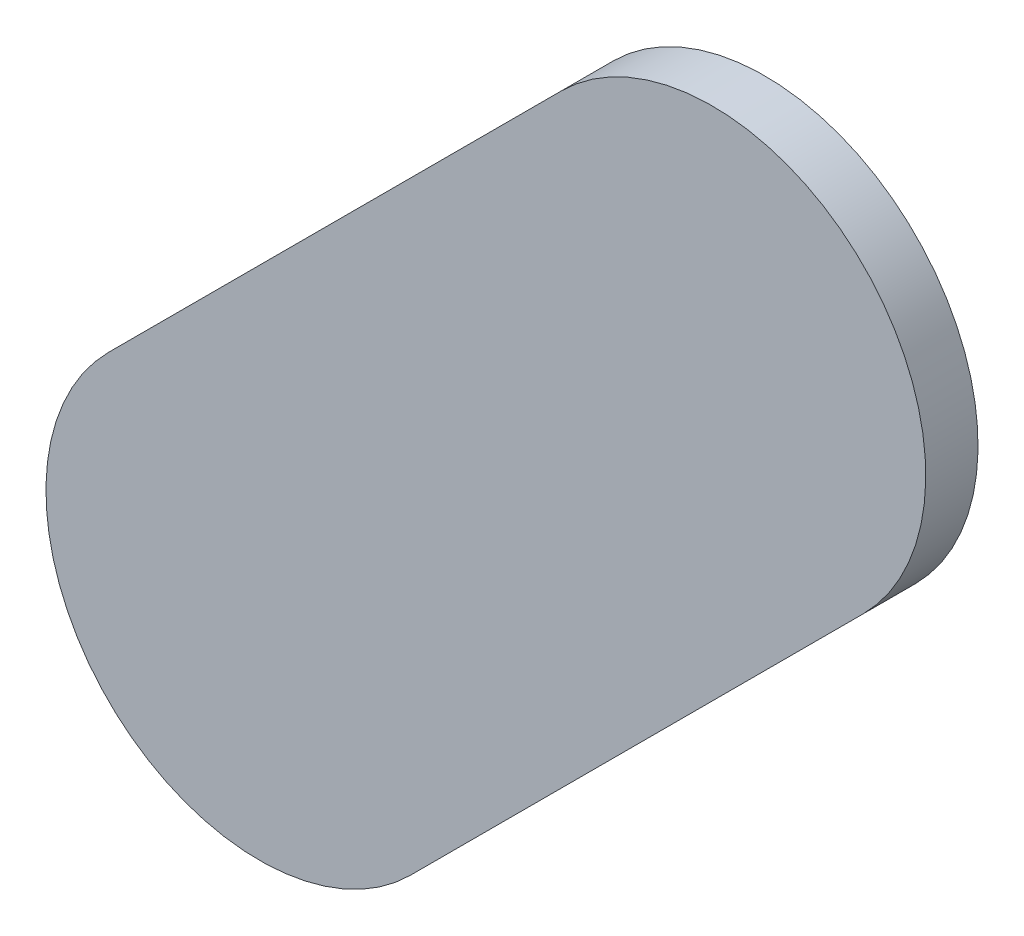
ISO-10303-21;
HEADER;
FILE_DESCRIPTION(('STEP AP214'),'2;1');
FILE_NAME('part.step','',(''),(''),'','','');
FILE_SCHEMA(('AUTOMOTIVE_DESIGN { 1 0 10303 214 1 1 1 1 }'));
ENDSEC;
DATA;
#1=APPLICATION_CONTEXT('core data for automotive mechanical design processes');
#2=APPLICATION_PROTOCOL_DEFINITION('international standard','automotive_design',2000,#1);
#3=PRODUCT_CONTEXT('',#1,'mechanical');
#4=PRODUCT('Part','Part','',(#3));
#5=PRODUCT_RELATED_PRODUCT_CATEGORY('part','',(#4));
#6=PRODUCT_DEFINITION_FORMATION('','',#4);
#7=PRODUCT_DEFINITION_CONTEXT('part definition',#1,'design');
#8=PRODUCT_DEFINITION('design','',#6,#7);
#9=PRODUCT_DEFINITION_SHAPE('','',#8);
#10=(LENGTH_UNIT() NAMED_UNIT(*) SI_UNIT(.MILLI.,.METRE.));
#11=(NAMED_UNIT(*) PLANE_ANGLE_UNIT() SI_UNIT($,.RADIAN.));
#12=(NAMED_UNIT(*) SI_UNIT($,.STERADIAN.) SOLID_ANGLE_UNIT());
#13=UNCERTAINTY_MEASURE_WITH_UNIT(LENGTH_MEASURE(1.E-05),#10,'distance_accuracy_value','');
#14=(GEOMETRIC_REPRESENTATION_CONTEXT(3) GLOBAL_UNCERTAINTY_ASSIGNED_CONTEXT((#13)) GLOBAL_UNIT_ASSIGNED_CONTEXT((#10,
#11,#12)) REPRESENTATION_CONTEXT('',''));
#15=CARTESIAN_POINT('',(0.,0.,0.));
#16=DIRECTION('',(0.,0.,1.));
#17=DIRECTION('',(1.,0.,0.));
#18=AXIS2_PLACEMENT_3D('',#15,#16,#17);
#19=CARTESIAN_POINT('',(7.544412089748,6.263751311465,0.79916));
#20=DIRECTION('',(0.,0.,1.));
#21=DIRECTION('',(1.,0.,0.));
#22=AXIS2_PLACEMENT_3D('',#19,#20,#21);
#23=PLANE('',#22);
#24=CARTESIAN_POINT('',(7.395919333,6.115258667,0.79916));
#25=DIRECTION('',(0.,0.,1.));
#26=DIRECTION('',(1.,0.,0.));
#27=AXIS2_PLACEMENT_3D('',#24,#25,#26);
#28=CIRCLE('',#27,0.139999666);
#29=CARTESIAN_POINT('',(7.49491465012217,6.01626398312202,0.79916));
#30=VERTEX_POINT('',#29);
#31=CARTESIAN_POINT('',(7.29692473875643,6.21425349914002,0.79916));
#32=VERTEX_POINT('',#31);
#33=EDGE_CURVE('E20',#30,#32,#28,.F.);
#34=ORIENTED_EDGE('',*,*,#33,.F.);
#35=DIRECTION('',(-0.707106660628037,-0.707106901745037,0.));
#36=VECTOR('',#35,1.);
#37=CARTESIAN_POINT('',(7.791899282866,6.313248717135,0.79916));
#38=LINE('',#37,#36);
#39=CARTESIAN_POINT('',(7.79189945805482,6.31324889232387,0.79916));
#40=VERTEX_POINT('',#39);
#41=EDGE_CURVE('E65',#30,#40,#38,.F.);
#42=ORIENTED_EDGE('',*,*,#41,.T.);
#43=CARTESIAN_POINT('',(7.692904333,6.412243768268,0.79916));
#44=DIRECTION('',(0.,0.,1.));
#45=DIRECTION('',(1.,0.,0.));
#46=AXIS2_PLACEMENT_3D('',#43,#44,#45);
#47=CIRCLE('',#46,0.14);
#48=CARTESIAN_POINT('',(7.59390931051548,6.51123864451574,0.79916));
#49=VERTEX_POINT('',#48);
#50=EDGE_CURVE('E57',#49,#40,#47,.F.);
#51=ORIENTED_EDGE('',*,*,#50,.F.);
#52=DIRECTION('',(0.707106098309218,0.707107464063218,0.));
#53=VECTOR('',#52,1.);
#54=CARTESIAN_POINT('',(7.296924953307,6.214253713691,0.79916));
#55=LINE('',#54,#53);
#56=EDGE_CURVE('E64',#49,#32,#55,.F.);
#57=ORIENTED_EDGE('',*,*,#56,.T.);
#58=EDGE_LOOP('',(#34,#42,#51,#57));
#59=FACE_BOUND('',#58,.T.);
#60=ADVANCED_FACE('F17',(#59),#23,.T.);
#61=CARTESIAN_POINT('',(7.791899282866,6.313248717135,0.76487));
#62=DIRECTION('',(-0.707106901745037,0.707106660628037,0.));
#63=DIRECTION('',(-0.707106660628037,-0.707106901745037,0.));
#64=AXIS2_PLACEMENT_3D('',#61,#62,#63);
#65=PLANE('',#64);
#66=DIRECTION('',(0.,0.,1.));
#67=VECTOR('',#66,1.);
#68=CARTESIAN_POINT('',(7.4949146670001,6.0162639999999,0.76487));
#69=LINE('',#68,#67);
#70=CARTESIAN_POINT('',(7.49491465012214,6.01626398312203,0.76487));
#71=VERTEX_POINT('',#70);
#72=EDGE_CURVE('E68',#71,#30,#69,.T.);
#73=ORIENTED_EDGE('',*,*,#72,.F.);
#74=DIRECTION('',(-0.70710666062813,-0.707106901744945,0.));
#75=VECTOR('',#74,1.);
#76=CARTESIAN_POINT('',(7.791899282866,6.313248717135,0.76487));
#77=LINE('',#76,#75);
#78=CARTESIAN_POINT('',(7.79189945805481,6.31324889232387,0.76487));
#79=VERTEX_POINT('',#78);
#80=EDGE_CURVE('E72',#79,#71,#77,.T.);
#81=ORIENTED_EDGE('',*,*,#80,.F.);
#82=DIRECTION('',(0.,0.,1.));
#83=VECTOR('',#82,1.);
#84=CARTESIAN_POINT('',(7.791899282866,6.313248717135,0.76487));
#85=LINE('',#84,#83);
#86=EDGE_CURVE('E60',#40,#79,#85,.F.);
#87=ORIENTED_EDGE('',*,*,#86,.F.);
#88=ORIENTED_EDGE('',*,*,#41,.F.);
#89=EDGE_LOOP('',(#73,#81,#87,#88));
#90=FACE_BOUND('',#89,.T.);
#91=ADVANCED_FACE('F70',(#90),#65,.F.);
#92=CARTESIAN_POINT('',(7.395919333,6.115258667,0.76487));
#93=DIRECTION('',(0.,0.,1.));
#94=DIRECTION('',(1.,0.,0.));
#95=AXIS2_PLACEMENT_3D('',#92,#93,#94);
#96=CYLINDRICAL_SURFACE('',#95,0.139999666);
#97=DIRECTION('',(0.,0.,1.));
#98=VECTOR('',#97,1.);
#99=CARTESIAN_POINT('',(7.296924953307,6.214253713691,0.76487));
#100=LINE('',#99,#98);
#101=CARTESIAN_POINT('',(7.29692473875646,6.21425349914005,0.76487));
#102=VERTEX_POINT('',#101);
#103=EDGE_CURVE('E77',#32,#102,#100,.F.);
#104=ORIENTED_EDGE('',*,*,#103,.T.);
#105=CARTESIAN_POINT('',(7.395919667,6.115258898732,0.76487));
#106=DIRECTION('',(0.,0.,1.));
#107=DIRECTION('',(1.,0.,0.));
#108=AXIS2_PLACEMENT_3D('',#105,#106,#107);
#109=CIRCLE('',#108,0.14);
#110=EDGE_CURVE('E26',#71,#102,#109,.F.);
#111=ORIENTED_EDGE('',*,*,#110,.F.);
#112=ORIENTED_EDGE('',*,*,#72,.T.);
#113=ORIENTED_EDGE('',*,*,#33,.T.);
#114=EDGE_LOOP('',(#104,#111,#112,#113));
#115=FACE_BOUND('',#114,.T.);
#116=ADVANCED_FACE('F88',(#115),#96,.T.);
#117=CARTESIAN_POINT('',(7.296924953307,6.214253713691,0.76487));
#118=DIRECTION('',(0.707107464063218,-0.707106098309218,0.));
#119=DIRECTION('',(0.707106098309218,0.707107464063218,0.));
#120=AXIS2_PLACEMENT_3D('',#117,#118,#119);
#121=PLANE('',#120);
#122=DIRECTION('',(0.,0.,1.));
#123=VECTOR('',#122,1.);
#124=CARTESIAN_POINT('',(7.5939093329999,6.5112386670001,0.76487));
#125=LINE('',#124,#123);
#126=CARTESIAN_POINT('',(7.59390931051561,6.51123864451567,0.76487));
#127=VERTEX_POINT('',#126);
#128=EDGE_CURVE('E62',#127,#49,#125,.T.);
#129=ORIENTED_EDGE('',*,*,#128,.F.);
#130=DIRECTION('',(0.70710609830961,0.707107464062826,0.));
#131=VECTOR('',#130,1.);
#132=CARTESIAN_POINT('',(7.296924953307,6.214253713691,0.76487));
#133=LINE('',#132,#131);
#134=EDGE_CURVE('E11',#102,#127,#133,.T.);
#135=ORIENTED_EDGE('',*,*,#134,.F.);
#136=ORIENTED_EDGE('',*,*,#103,.F.);
#137=ORIENTED_EDGE('',*,*,#56,.F.);
#138=EDGE_LOOP('',(#129,#135,#136,#137));
#139=FACE_BOUND('',#138,.T.);
#140=ADVANCED_FACE('F96',(#139),#121,.F.);
#141=CARTESIAN_POINT('',(7.692904333,6.412243768268,0.76487));
#142=DIRECTION('',(0.,0.,1.));
#143=DIRECTION('',(1.,0.,0.));
#144=AXIS2_PLACEMENT_3D('',#141,#142,#143);
#145=CYLINDRICAL_SURFACE('',#144,0.14);
#146=CARTESIAN_POINT('',(7.692904667,6.412244,0.76487));
#147=DIRECTION('',(0.,0.,1.));
#148=DIRECTION('',(1.,0.,0.));
#149=AXIS2_PLACEMENT_3D('',#146,#147,#148);
#150=CIRCLE('',#149,0.14);
#151=EDGE_CURVE('E35',#127,#79,#150,.F.);
#152=ORIENTED_EDGE('',*,*,#151,.F.);
#153=ORIENTED_EDGE('',*,*,#128,.T.);
#154=ORIENTED_EDGE('',*,*,#50,.T.);
#155=ORIENTED_EDGE('',*,*,#86,.T.);
#156=EDGE_LOOP('',(#152,#153,#154,#155));
#157=FACE_BOUND('',#156,.T.);
#158=ADVANCED_FACE('F58',(#157),#145,.T.);
#159=CARTESIAN_POINT('',(7.544412089748,6.263751311465,0.76487));
#160=DIRECTION('',(0.,0.,-1.));
#161=DIRECTION('',(-1.,0.,0.));
#162=AXIS2_PLACEMENT_3D('',#159,#160,#161);
#163=PLANE('',#162);
#164=ORIENTED_EDGE('',*,*,#134,.T.);
#165=ORIENTED_EDGE('',*,*,#151,.T.);
#166=ORIENTED_EDGE('',*,*,#80,.T.);
#167=ORIENTED_EDGE('',*,*,#110,.T.);
#168=EDGE_LOOP('',(#164,#165,#166,#167));
#169=FACE_BOUND('',#168,.T.);
#170=ADVANCED_FACE('F89',(#169),#163,.T.);
#171=CLOSED_SHELL('',(#60,#91,#116,#140,#158,#170));
#172=MANIFOLD_SOLID_BREP('B1',#171);
#173=ADVANCED_BREP_SHAPE_REPRESENTATION('',(#18,#172),#14);
#174=SHAPE_DEFINITION_REPRESENTATION(#9,#173);
ENDSEC;
END-ISO-10303-21;
